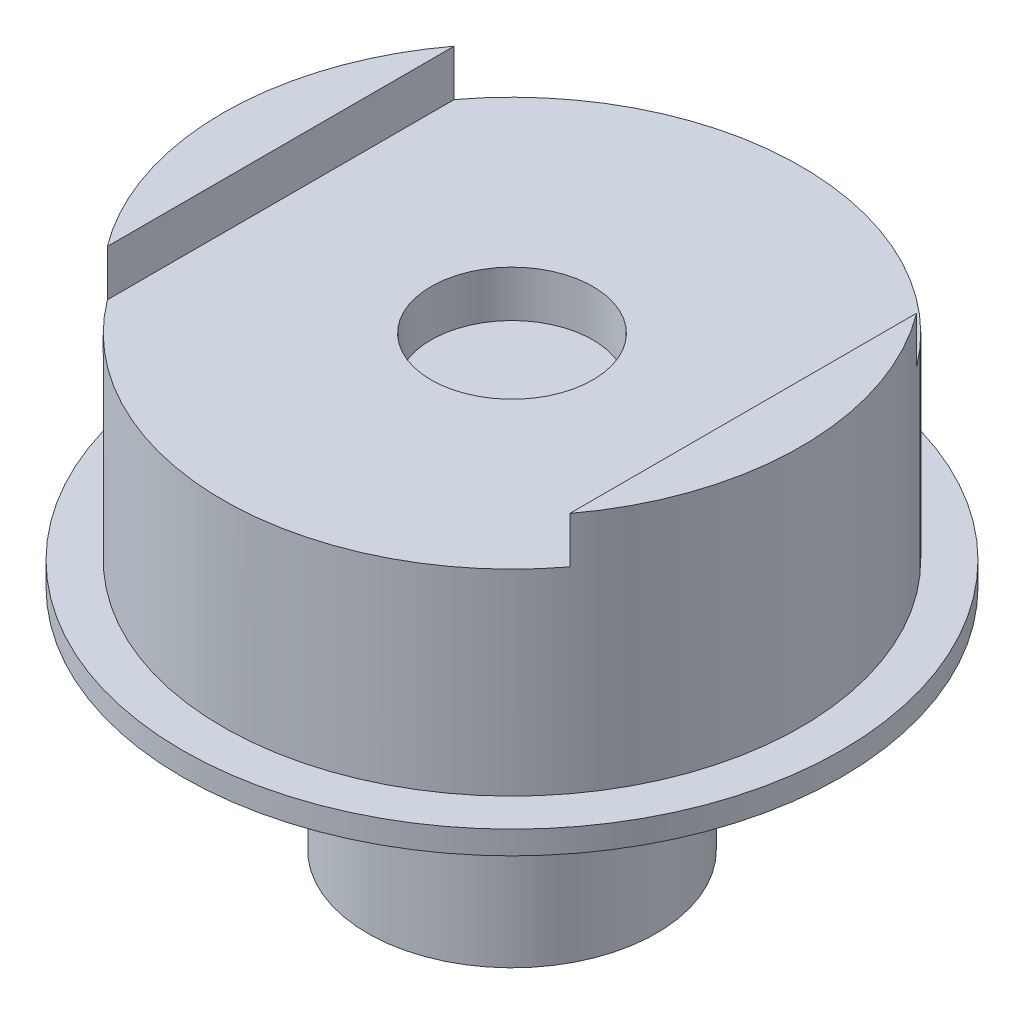
ISO-10303-21;
HEADER;
FILE_DESCRIPTION(('STEP AP214'),'2;1');
FILE_NAME('part.step','',(''),(''),'','','');
FILE_SCHEMA(('AUTOMOTIVE_DESIGN { 1 0 10303 214 1 1 1 1 }'));
ENDSEC;
DATA;
#1=APPLICATION_CONTEXT('core data for automotive mechanical design processes');
#2=APPLICATION_PROTOCOL_DEFINITION('international standard','automotive_design',2000,#1);
#3=PRODUCT_CONTEXT('',#1,'mechanical');
#4=PRODUCT('Part','Part','',(#3));
#5=PRODUCT_RELATED_PRODUCT_CATEGORY('part','',(#4));
#6=PRODUCT_DEFINITION_FORMATION('','',#4);
#7=PRODUCT_DEFINITION_CONTEXT('part definition',#1,'design');
#8=PRODUCT_DEFINITION('design','',#6,#7);
#9=PRODUCT_DEFINITION_SHAPE('','',#8);
#10=(LENGTH_UNIT() NAMED_UNIT(*) SI_UNIT(.MILLI.,.METRE.));
#11=(NAMED_UNIT(*) PLANE_ANGLE_UNIT() SI_UNIT($,.RADIAN.));
#12=(NAMED_UNIT(*) SI_UNIT($,.STERADIAN.) SOLID_ANGLE_UNIT());
#13=UNCERTAINTY_MEASURE_WITH_UNIT(LENGTH_MEASURE(1.E-05),#10,'distance_accuracy_value','');
#14=(GEOMETRIC_REPRESENTATION_CONTEXT(3) GLOBAL_UNCERTAINTY_ASSIGNED_CONTEXT((#13)) GLOBAL_UNIT_ASSIGNED_CONTEXT((#10,
#11,#12)) REPRESENTATION_CONTEXT('',''));
#15=CARTESIAN_POINT('',(0.,0.,0.));
#16=DIRECTION('',(0.,0.,1.));
#17=DIRECTION('',(1.,0.,0.));
#18=AXIS2_PLACEMENT_3D('',#15,#16,#17);
#19=CARTESIAN_POINT('',(0.,21.,0.));
#20=DIRECTION('',(0.,-1.,0.));
#21=DIRECTION('',(1.,0.,0.));
#22=AXIS2_PLACEMENT_3D('',#19,#20,#21);
#23=PLANE('',#22);
#24=CARTESIAN_POINT('',(0.,21.,0.));
#25=DIRECTION('',(0.,1.,0.));
#26=DIRECTION('',(-1.,0.,0.));
#27=AXIS2_PLACEMENT_3D('',#24,#25,#26);
#28=CIRCLE('',#27,25.);
#29=CARTESIAN_POINT('',(20.,21.,15.));
#30=VERTEX_POINT('',#29);
#31=CARTESIAN_POINT('',(20.,21.,-15.));
#32=VERTEX_POINT('',#31);
#33=EDGE_CURVE('E81',#30,#32,#28,.T.);
#34=ORIENTED_EDGE('',*,*,#33,.T.);
#35=DIRECTION('',(0.,0.,-1.));
#36=VECTOR('',#35,1.);
#37=CARTESIAN_POINT('',(20.,21.,28.5));
#38=LINE('',#37,#36);
#39=EDGE_CURVE('E74',#30,#32,#38,.T.);
#40=ORIENTED_EDGE('',*,*,#39,.F.);
#41=EDGE_LOOP('',(#34,#40));
#42=FACE_BOUND('',#41,.T.);
#43=ADVANCED_FACE('F33',(#42),#23,.F.);
#44=CARTESIAN_POINT('',(0.,41.9210701534302,0.));
#45=DIRECTION('',(0.,1.,0.));
#46=DIRECTION('',(-1.,0.,0.));
#47=AXIS2_PLACEMENT_3D('',#44,#45,#46);
#48=CYLINDRICAL_SURFACE('',#47,8.);
#49=CARTESIAN_POINT('',(0.,-21.7,0.));
#50=DIRECTION('',(0.,1.,0.));
#51=DIRECTION('',(-1.,0.,0.));
#52=AXIS2_PLACEMENT_3D('',#49,#50,#51);
#53=CIRCLE('',#52,8.);
#54=CARTESIAN_POINT('',(-7.99999999999999,-21.7,0.));
#55=VERTEX_POINT('',#54);
#56=EDGE_CURVE('E108',#55,#55,#53,.T.);
#57=ORIENTED_EDGE('',*,*,#56,.F.);
#58=EDGE_LOOP('',(#57));
#59=FACE_BOUND('',#58,.T.);
#60=CARTESIAN_POINT('',(0.,2.29999999999999,0.));
#61=DIRECTION('',(0.,1.,0.));
#62=DIRECTION('',(-1.,0.,0.));
#63=AXIS2_PLACEMENT_3D('',#60,#61,#62);
#64=CIRCLE('',#63,8.);
#65=CARTESIAN_POINT('',(-7.99999999999999,2.29999999999999,0.));
#66=VERTEX_POINT('',#65);
#67=EDGE_CURVE('E89',#66,#66,#64,.T.);
#68=ORIENTED_EDGE('',*,*,#67,.T.);
#69=EDGE_LOOP('',(#68));
#70=FACE_BOUND('',#69,.T.);
#71=ADVANCED_FACE('F35',(#59,#70),#48,.F.);
#72=CARTESIAN_POINT('',(0.,2.29999999999999,0.));
#73=DIRECTION('',(0.,1.,0.));
#74=DIRECTION('',(-1.,0.,0.));
#75=AXIS2_PLACEMENT_3D('',#72,#73,#74);
#76=PLANE('',#75);
#77=ORIENTED_EDGE('',*,*,#67,.F.);
#78=EDGE_LOOP('',(#77));
#79=FACE_BOUND('',#78,.T.);
#80=ADVANCED_FACE('F149',(#79),#76,.F.);
#81=CARTESIAN_POINT('',(-20.,21.,-15.));
#82=VERTEX_POINT('',#81);
#83=CARTESIAN_POINT('',(-20.,21.,15.));
#84=VERTEX_POINT('',#83);
#85=EDGE_CURVE('E90',#82,#84,#28,.T.);
#86=ORIENTED_EDGE('',*,*,#85,.T.);
#87=DIRECTION('',(0.,0.,1.));
#88=VECTOR('',#87,1.);
#89=CARTESIAN_POINT('',(-20.,21.,28.5));
#90=LINE('',#89,#88);
#91=EDGE_CURVE('E82',#82,#84,#90,.T.);
#92=ORIENTED_EDGE('',*,*,#91,.F.);
#93=EDGE_LOOP('',(#86,#92));
#94=FACE_BOUND('',#93,.T.);
#95=ADVANCED_FACE('F142',(#94),#23,.F.);
#96=CARTESIAN_POINT('',(0.,41.9210701534302,0.));
#97=DIRECTION('',(0.,1.,0.));
#98=DIRECTION('',(-1.,0.,0.));
#99=AXIS2_PLACEMENT_3D('',#96,#97,#98);
#100=CYLINDRICAL_SURFACE('',#99,25.);
#101=ORIENTED_EDGE('',*,*,#33,.F.);
#102=DIRECTION('',(0.,1.,0.));
#103=VECTOR('',#102,1.);
#104=CARTESIAN_POINT('',(20.,41.9210701534302,15.));
#105=LINE('',#104,#103);
#106=CARTESIAN_POINT('',(20.,17.,15.));
#107=VERTEX_POINT('',#106);
#108=EDGE_CURVE('E11',#30,#107,#105,.F.);
#109=ORIENTED_EDGE('',*,*,#108,.T.);
#110=CARTESIAN_POINT('',(0.,17.,0.));
#111=DIRECTION('',(0.,-1.,0.));
#112=DIRECTION('',(0.,0.,-1.));
#113=AXIS2_PLACEMENT_3D('',#110,#111,#112);
#114=CIRCLE('',#113,25.);
#115=CARTESIAN_POINT('',(-20.,17.,15.));
#116=VERTEX_POINT('',#115);
#117=EDGE_CURVE('E102',#107,#116,#114,.T.);
#118=ORIENTED_EDGE('',*,*,#117,.T.);
#119=DIRECTION('',(0.,1.,0.));
#120=VECTOR('',#119,1.);
#121=CARTESIAN_POINT('',(-20.,41.9210701534302,15.));
#122=LINE('',#121,#120);
#123=EDGE_CURVE('E41',#116,#84,#122,.T.);
#124=ORIENTED_EDGE('',*,*,#123,.T.);
#125=ORIENTED_EDGE('',*,*,#85,.F.);
#126=DIRECTION('',(0.,1.,0.));
#127=VECTOR('',#126,1.);
#128=CARTESIAN_POINT('',(-20.,41.9210701534302,-15.));
#129=LINE('',#128,#127);
#130=CARTESIAN_POINT('',(-20.,17.,-15.));
#131=VERTEX_POINT('',#130);
#132=EDGE_CURVE('E101',#82,#131,#129,.F.);
#133=ORIENTED_EDGE('',*,*,#132,.T.);
#134=CARTESIAN_POINT('',(20.,17.,-15.));
#135=VERTEX_POINT('',#134);
#136=EDGE_CURVE('E93',#131,#135,#114,.T.);
#137=ORIENTED_EDGE('',*,*,#136,.T.);
#138=DIRECTION('',(0.,1.,0.));
#139=VECTOR('',#138,1.);
#140=CARTESIAN_POINT('',(20.,41.9210701534302,-15.));
#141=LINE('',#140,#139);
#142=EDGE_CURVE('E88',#135,#32,#141,.T.);
#143=ORIENTED_EDGE('',*,*,#142,.T.);
#144=EDGE_LOOP('',(#101,#109,#118,#124,#125,#133,#137,#143));
#145=FACE_BOUND('',#144,.T.);
#146=CARTESIAN_POINT('',(0.,0.,0.));
#147=DIRECTION('',(0.,1.,0.));
#148=DIRECTION('',(-1.,0.,0.));
#149=AXIS2_PLACEMENT_3D('',#146,#147,#148);
#150=CIRCLE('',#149,25.);
#151=CARTESIAN_POINT('',(-25.,0.,0.));
#152=VERTEX_POINT('',#151);
#153=EDGE_CURVE('E96',#152,#152,#150,.T.);
#154=ORIENTED_EDGE('',*,*,#153,.T.);
#155=EDGE_LOOP('',(#154));
#156=FACE_BOUND('',#155,.T.);
#157=ADVANCED_FACE('F85',(#145,#156),#100,.T.);
#158=CARTESIAN_POINT('',(25.,0.,0.));
#159=DIRECTION('',(0.,-1.,0.));
#160=DIRECTION('',(1.,0.,0.));
#161=AXIS2_PLACEMENT_3D('',#158,#159,#160);
#162=PLANE('',#161);
#163=ORIENTED_EDGE('',*,*,#153,.F.);
#164=EDGE_LOOP('',(#163));
#165=FACE_BOUND('',#164,.T.);
#166=CARTESIAN_POINT('',(0.,0.,0.));
#167=DIRECTION('',(0.,1.,0.));
#168=DIRECTION('',(-1.,0.,0.));
#169=AXIS2_PLACEMENT_3D('',#166,#167,#168);
#170=CIRCLE('',#169,28.5);
#171=CARTESIAN_POINT('',(-28.5,0.,0.));
#172=VERTEX_POINT('',#171);
#173=EDGE_CURVE('E124',#172,#172,#170,.T.);
#174=ORIENTED_EDGE('',*,*,#173,.T.);
#175=EDGE_LOOP('',(#174));
#176=FACE_BOUND('',#175,.T.);
#177=ADVANCED_FACE('F131',(#165,#176),#162,.F.);
#178=CARTESIAN_POINT('',(0.,41.9210701534302,0.));
#179=DIRECTION('',(0.,1.,0.));
#180=DIRECTION('',(-1.,0.,0.));
#181=AXIS2_PLACEMENT_3D('',#178,#179,#180);
#182=CYLINDRICAL_SURFACE('',#181,28.5);
#183=ORIENTED_EDGE('',*,*,#173,.F.);
#184=EDGE_LOOP('',(#183));
#185=FACE_BOUND('',#184,.T.);
#186=CARTESIAN_POINT('',(0.,-2.00000000000001,0.));
#187=DIRECTION('',(0.,1.,0.));
#188=DIRECTION('',(-1.,0.,0.));
#189=AXIS2_PLACEMENT_3D('',#186,#187,#188);
#190=CIRCLE('',#189,28.5);
#191=CARTESIAN_POINT('',(-28.5,-2.00000000000001,0.));
#192=VERTEX_POINT('',#191);
#193=EDGE_CURVE('E122',#192,#192,#190,.T.);
#194=ORIENTED_EDGE('',*,*,#193,.T.);
#195=EDGE_LOOP('',(#194));
#196=FACE_BOUND('',#195,.T.);
#197=ADVANCED_FACE('F133',(#185,#196),#182,.T.);
#198=CARTESIAN_POINT('',(28.5,-2.00000000000001,0.));
#199=DIRECTION('',(0.,1.,0.));
#200=DIRECTION('',(-1.,0.,0.));
#201=AXIS2_PLACEMENT_3D('',#198,#199,#200);
#202=PLANE('',#201);
#203=ORIENTED_EDGE('',*,*,#193,.F.);
#204=EDGE_LOOP('',(#203));
#205=FACE_BOUND('',#204,.T.);
#206=CARTESIAN_POINT('',(0.,-2.00000000000002,0.));
#207=DIRECTION('',(0.,1.,0.));
#208=DIRECTION('',(-1.,0.,0.));
#209=AXIS2_PLACEMENT_3D('',#206,#207,#208);
#210=CIRCLE('',#209,12.5);
#211=CARTESIAN_POINT('',(-12.5,-2.00000000000002,0.));
#212=VERTEX_POINT('',#211);
#213=EDGE_CURVE('E119',#212,#212,#210,.T.);
#214=ORIENTED_EDGE('',*,*,#213,.T.);
#215=EDGE_LOOP('',(#214));
#216=FACE_BOUND('',#215,.T.);
#217=ADVANCED_FACE('F139',(#205,#216),#202,.F.);
#218=CARTESIAN_POINT('',(0.,41.9210701534302,0.));
#219=DIRECTION('',(0.,1.,0.));
#220=DIRECTION('',(-1.,0.,0.));
#221=AXIS2_PLACEMENT_3D('',#218,#219,#220);
#222=CYLINDRICAL_SURFACE('',#221,12.5);
#223=ORIENTED_EDGE('',*,*,#213,.F.);
#224=EDGE_LOOP('',(#223));
#225=FACE_BOUND('',#224,.T.);
#226=CARTESIAN_POINT('',(0.,-21.7,0.));
#227=DIRECTION('',(0.,1.,0.));
#228=DIRECTION('',(-1.,0.,0.));
#229=AXIS2_PLACEMENT_3D('',#226,#227,#228);
#230=CIRCLE('',#229,12.5);
#231=CARTESIAN_POINT('',(-12.5,-21.7,0.));
#232=VERTEX_POINT('',#231);
#233=EDGE_CURVE('E111',#232,#232,#230,.T.);
#234=ORIENTED_EDGE('',*,*,#233,.T.);
#235=EDGE_LOOP('',(#234));
#236=FACE_BOUND('',#235,.T.);
#237=ADVANCED_FACE('F174',(#225,#236),#222,.T.);
#238=CARTESIAN_POINT('',(12.5,-21.7,0.));
#239=DIRECTION('',(0.,1.,0.));
#240=DIRECTION('',(-1.,0.,0.));
#241=AXIS2_PLACEMENT_3D('',#238,#239,#240);
#242=PLANE('',#241);
#243=ORIENTED_EDGE('',*,*,#233,.F.);
#244=EDGE_LOOP('',(#243));
#245=FACE_BOUND('',#244,.T.);
#246=ORIENTED_EDGE('',*,*,#56,.T.);
#247=EDGE_LOOP('',(#246));
#248=FACE_BOUND('',#247,.T.);
#249=ADVANCED_FACE('F168',(#245,#248),#242,.F.);
#250=CARTESIAN_POINT('',(20.,17.,28.5));
#251=DIRECTION('',(1.,0.,0.));
#252=DIRECTION('',(0.,0.,-1.));
#253=AXIS2_PLACEMENT_3D('',#250,#251,#252);
#254=PLANE('',#253);
#255=DIRECTION('',(0.,0.,-1.));
#256=VECTOR('',#255,1.);
#257=CARTESIAN_POINT('',(20.,17.,28.5));
#258=LINE('',#257,#256);
#259=EDGE_CURVE('E48',#107,#135,#258,.T.);
#260=ORIENTED_EDGE('',*,*,#259,.F.);
#261=ORIENTED_EDGE('',*,*,#108,.F.);
#262=ORIENTED_EDGE('',*,*,#39,.T.);
#263=ORIENTED_EDGE('',*,*,#142,.F.);
#264=EDGE_LOOP('',(#260,#261,#262,#263));
#265=FACE_BOUND('',#264,.T.);
#266=ADVANCED_FACE('F73',(#265),#254,.F.);
#267=CARTESIAN_POINT('',(-20.,17.,28.5));
#268=DIRECTION('',(-1.,0.,0.));
#269=DIRECTION('',(0.,0.,1.));
#270=AXIS2_PLACEMENT_3D('',#267,#268,#269);
#271=PLANE('',#270);
#272=DIRECTION('',(0.,0.,1.));
#273=VECTOR('',#272,1.);
#274=CARTESIAN_POINT('',(-20.,17.,28.5));
#275=LINE('',#274,#273);
#276=EDGE_CURVE('E107',#131,#116,#275,.T.);
#277=ORIENTED_EDGE('',*,*,#276,.F.);
#278=ORIENTED_EDGE('',*,*,#132,.F.);
#279=ORIENTED_EDGE('',*,*,#91,.T.);
#280=ORIENTED_EDGE('',*,*,#123,.F.);
#281=EDGE_LOOP('',(#277,#278,#279,#280));
#282=FACE_BOUND('',#281,.T.);
#283=ADVANCED_FACE('F158',(#282),#271,.F.);
#284=CARTESIAN_POINT('',(0.,17.,0.));
#285=DIRECTION('',(0.,-1.,0.));
#286=DIRECTION('',(0.,0.,-1.));
#287=AXIS2_PLACEMENT_3D('',#284,#285,#286);
#288=PLANE('',#287);
#289=CARTESIAN_POINT('',(0.,17.,0.));
#290=DIRECTION('',(0.,1.,0.));
#291=DIRECTION('',(0.,0.,1.));
#292=AXIS2_PLACEMENT_3D('',#289,#290,#291);
#293=CIRCLE('',#292,7.);
#294=CARTESIAN_POINT('',(0.,17.,7.));
#295=VERTEX_POINT('',#294);
#296=EDGE_CURVE('E245',#295,#295,#293,.T.);
#297=ORIENTED_EDGE('',*,*,#296,.F.);
#298=EDGE_LOOP('',(#297));
#299=FACE_BOUND('',#298,.T.);
#300=ORIENTED_EDGE('',*,*,#259,.T.);
#301=ORIENTED_EDGE('',*,*,#136,.F.);
#302=ORIENTED_EDGE('',*,*,#276,.T.);
#303=ORIENTED_EDGE('',*,*,#117,.F.);
#304=EDGE_LOOP('',(#300,#301,#302,#303));
#305=FACE_BOUND('',#304,.T.);
#306=ADVANCED_FACE('F106',(#299,#305),#288,.F.);
#307=CARTESIAN_POINT('',(0.,13.,0.));
#308=DIRECTION('',(0.,1.,0.));
#309=DIRECTION('',(0.,0.,1.));
#310=AXIS2_PLACEMENT_3D('',#307,#308,#309);
#311=CYLINDRICAL_SURFACE('',#310,7.);
#312=CARTESIAN_POINT('',(0.,13.,0.));
#313=DIRECTION('',(0.,1.,0.));
#314=DIRECTION('',(0.,0.,1.));
#315=AXIS2_PLACEMENT_3D('',#312,#313,#314);
#316=CIRCLE('',#315,7.);
#317=CARTESIAN_POINT('',(0.,13.,7.));
#318=VERTEX_POINT('',#317);
#319=EDGE_CURVE('E83',#318,#318,#316,.T.);
#320=ORIENTED_EDGE('',*,*,#319,.F.);
#321=EDGE_LOOP('',(#320));
#322=FACE_BOUND('',#321,.T.);
#323=ORIENTED_EDGE('',*,*,#296,.T.);
#324=EDGE_LOOP('',(#323));
#325=FACE_BOUND('',#324,.T.);
#326=ADVANCED_FACE('F165',(#322,#325),#311,.F.);
#327=CARTESIAN_POINT('',(0.,13.,0.));
#328=DIRECTION('',(0.,1.,0.));
#329=DIRECTION('',(0.,0.,1.));
#330=AXIS2_PLACEMENT_3D('',#327,#328,#329);
#331=PLANE('',#330);
#332=ORIENTED_EDGE('',*,*,#319,.T.);
#333=EDGE_LOOP('',(#332));
#334=FACE_BOUND('',#333,.T.);
#335=ADVANCED_FACE('F230',(#334),#331,.T.);
#336=CLOSED_SHELL('',(#43,#71,#80,#95,#157,#177,#197,#217,#237,#249,#266,#283,#306,#326,#335));
#337=MANIFOLD_SOLID_BREP('B2',#336);
#338=ADVANCED_BREP_SHAPE_REPRESENTATION('',(#18,#337),#14);
#339=SHAPE_DEFINITION_REPRESENTATION(#9,#338);
ENDSEC;
END-ISO-10303-21;
